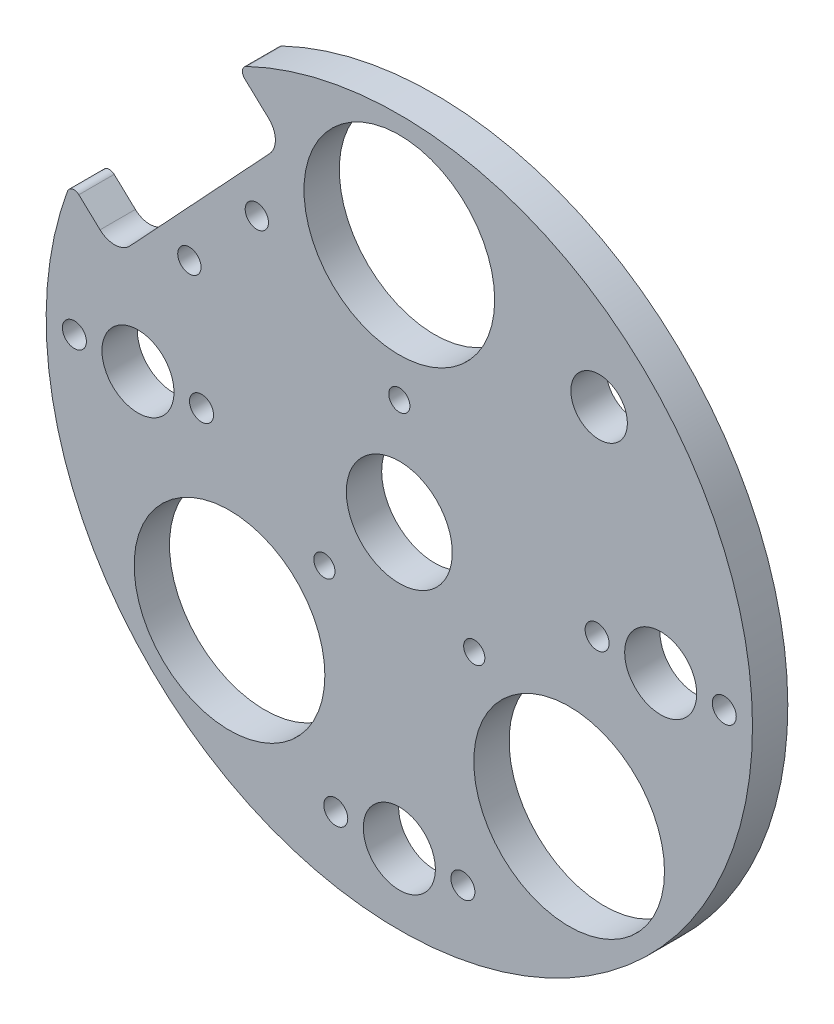
ISO-10303-21;
HEADER;
FILE_DESCRIPTION(('STEP AP214'),'2;1');
FILE_NAME('part.step','',(''),(''),'','','');
FILE_SCHEMA(('AUTOMOTIVE_DESIGN { 1 0 10303 214 1 1 1 1 }'));
ENDSEC;
DATA;
#1=APPLICATION_CONTEXT('core data for automotive mechanical design processes');
#2=APPLICATION_PROTOCOL_DEFINITION('international standard','automotive_design',2000,#1);
#3=PRODUCT_CONTEXT('',#1,'mechanical');
#4=PRODUCT('Part','Part','',(#3));
#5=PRODUCT_RELATED_PRODUCT_CATEGORY('part','',(#4));
#6=PRODUCT_DEFINITION_FORMATION('','',#4);
#7=PRODUCT_DEFINITION_CONTEXT('part definition',#1,'design');
#8=PRODUCT_DEFINITION('design','',#6,#7);
#9=PRODUCT_DEFINITION_SHAPE('','',#8);
#10=(LENGTH_UNIT() NAMED_UNIT(*) SI_UNIT(.MILLI.,.METRE.));
#11=(NAMED_UNIT(*) PLANE_ANGLE_UNIT() SI_UNIT($,.RADIAN.));
#12=(NAMED_UNIT(*) SI_UNIT($,.STERADIAN.) SOLID_ANGLE_UNIT());
#13=UNCERTAINTY_MEASURE_WITH_UNIT(LENGTH_MEASURE(1.E-05),#10,'distance_accuracy_value','');
#14=(GEOMETRIC_REPRESENTATION_CONTEXT(3) GLOBAL_UNCERTAINTY_ASSIGNED_CONTEXT((#13)) GLOBAL_UNIT_ASSIGNED_CONTEXT((#10,
#11,#12)) REPRESENTATION_CONTEXT('',''));
#15=CARTESIAN_POINT('',(0.,0.,0.));
#16=DIRECTION('',(0.,0.,1.));
#17=DIRECTION('',(1.,0.,0.));
#18=AXIS2_PLACEMENT_3D('',#15,#16,#17);
#19=CARTESIAN_POINT('',(0.,0.,5.));
#20=DIRECTION('',(0.,0.,-1.));
#21=DIRECTION('',(-1.,0.,0.));
#22=AXIS2_PLACEMENT_3D('',#19,#20,#21);
#23=CYLINDRICAL_SURFACE('',#22,50.);
#24=CARTESIAN_POINT('',(0.,0.,5.));
#25=DIRECTION('',(0.,0.,1.));
#26=DIRECTION('',(1.,0.,0.));
#27=AXIS2_PLACEMENT_3D('',#24,#25,#26);
#28=CIRCLE('',#27,50.);
#29=CARTESIAN_POINT('',(-46.9912122947557,17.0829144781915,5.));
#30=VERTEX_POINT('',#29);
#31=CARTESIAN_POINT('',(-21.6459347442073,45.0716486169468,5.));
#32=VERTEX_POINT('',#31);
#33=EDGE_CURVE('E219',#30,#32,#28,.T.);
#34=ORIENTED_EDGE('',*,*,#33,.F.);
#35=DIRECTION('',(0.,0.,-1.));
#36=VECTOR('',#35,1.);
#37=CARTESIAN_POINT('',(-46.9912122947557,17.0829144781915,5.));
#38=LINE('',#37,#36);
#39=CARTESIAN_POINT('',(-46.9912122947557,17.0829144781915,0.));
#40=VERTEX_POINT('',#39);
#41=EDGE_CURVE('E263',#30,#40,#38,.T.);
#42=ORIENTED_EDGE('',*,*,#41,.T.);
#43=CARTESIAN_POINT('',(0.,0.,0.));
#44=DIRECTION('',(0.,0.,1.));
#45=DIRECTION('',(1.,0.,0.));
#46=AXIS2_PLACEMENT_3D('',#43,#44,#45);
#47=CIRCLE('',#46,50.);
#48=CARTESIAN_POINT('',(-21.6459347442073,45.0716486169468,0.));
#49=VERTEX_POINT('',#48);
#50=EDGE_CURVE('E218',#40,#49,#47,.T.);
#51=ORIENTED_EDGE('',*,*,#50,.T.);
#52=DIRECTION('',(0.,0.,-1.));
#53=VECTOR('',#52,1.);
#54=CARTESIAN_POINT('',(-21.6459347442073,45.0716486169468,5.));
#55=LINE('',#54,#53);
#56=EDGE_CURVE('E251',#49,#32,#55,.F.);
#57=ORIENTED_EDGE('',*,*,#56,.T.);
#58=EDGE_LOOP('',(#34,#42,#51,#57));
#59=FACE_BOUND('',#58,.T.);
#60=ADVANCED_FACE('F34',(#59),#23,.T.);
#61=CARTESIAN_POINT('',(0.,0.,5.));
#62=DIRECTION('',(0.,0.,1.));
#63=DIRECTION('',(1.,0.,0.));
#64=AXIS2_PLACEMENT_3D('',#61,#62,#63);
#65=PLANE('',#64);
#66=CARTESIAN_POINT('',(28.2842712474618,28.284271247462,5.));
#67=DIRECTION('',(0.,0.,1.));
#68=DIRECTION('',(1.,0.,0.));
#69=AXIS2_PLACEMENT_3D('',#66,#67,#68);
#70=CIRCLE('',#69,4.00000000000002);
#71=CARTESIAN_POINT('',(32.2842712474619,28.284271247462,5.));
#72=VERTEX_POINT('',#71);
#73=EDGE_CURVE('E260',#72,#72,#70,.T.);
#74=ORIENTED_EDGE('',*,*,#73,.F.);
#75=EDGE_LOOP('',(#74));
#76=FACE_BOUND('',#75,.T.);
#77=CARTESIAN_POINT('',(-29.7224002312923,17.238494510021,5.));
#78=DIRECTION('',(0.,0.,1.));
#79=DIRECTION('',(1.,0.,0.));
#80=AXIS2_PLACEMENT_3D('',#77,#78,#79);
#81=CIRCLE('',#80,1.65);
#82=CARTESIAN_POINT('',(-28.0724002312923,17.238494510021,5.));
#83=VERTEX_POINT('',#82);
#84=EDGE_CURVE('E259',#83,#83,#81,.T.);
#85=ORIENTED_EDGE('',*,*,#84,.F.);
#86=EDGE_LOOP('',(#85));
#87=FACE_BOUND('',#86,.T.);
#88=CARTESIAN_POINT('',(-20.1744231904173,27.4774463326893,5.));
#89=DIRECTION('',(0.,0.,1.));
#90=DIRECTION('',(1.,0.,0.));
#91=AXIS2_PLACEMENT_3D('',#88,#89,#90);
#92=CIRCLE('',#91,1.65);
#93=CARTESIAN_POINT('',(-18.5244231904173,27.4774463326893,5.));
#94=VERTEX_POINT('',#93);
#95=EDGE_CURVE('E106',#94,#94,#92,.T.);
#96=ORIENTED_EDGE('',*,*,#95,.F.);
#97=EDGE_LOOP('',(#96));
#98=FACE_BOUND('',#97,.T.);
#99=DIRECTION('',(0.731353701619167,-0.681998360062502,0.));
#100=VECTOR('',#99,1.);
#101=CARTESIAN_POINT('',(-42.3685357740924,14.6742683434885,5.));
#102=LINE('',#101,#100);
#103=CARTESIAN_POINT('',(-45.369389688798,17.4726098902468,5.));
#104=VERTEX_POINT('',#103);
#105=CARTESIAN_POINT('',(-42.3685357740924,14.6742683434885,5.));
#106=VERTEX_POINT('',#105);
#107=EDGE_CURVE('E98',#104,#106,#102,.T.);
#108=ORIENTED_EDGE('',*,*,#107,.F.);
#109=CARTESIAN_POINT('',(-46.0513880488605,16.7412561886277,5.));
#110=DIRECTION('',(0.,0.,1.));
#111=DIRECTION('',(1.,0.,0.));
#112=AXIS2_PLACEMENT_3D('',#109,#110,#111);
#113=CIRCLE('',#112,1.);
#114=EDGE_CURVE('E42',#104,#30,#113,.T.);
#115=ORIENTED_EDGE('',*,*,#114,.T.);
#116=ORIENTED_EDGE('',*,*,#33,.T.);
#117=CARTESIAN_POINT('',(-21.2130160493232,44.1702156446078,5.));
#118=DIRECTION('',(0.,0.,1.));
#119=DIRECTION('',(1.,0.,0.));
#120=AXIS2_PLACEMENT_3D('',#117,#118,#119);
#121=CIRCLE('',#120,1.);
#122=CARTESIAN_POINT('',(-21.8950144093857,43.4388619429887,5.));
#123=VERTEX_POINT('',#122);
#124=EDGE_CURVE('E49',#32,#123,#121,.T.);
#125=ORIENTED_EDGE('',*,*,#124,.T.);
#126=DIRECTION('',(-0.731353701619168,0.681998360062501,0.));
#127=VECTOR('',#126,1.);
#128=CARTESIAN_POINT('',(-27.2748375913348,48.4556282209094,5.));
#129=LINE('',#128,#127);
#130=CARTESIAN_POINT('',(-18.4985931719048,40.2716479001594,5.));
#131=VERTEX_POINT('',#130);
#132=EDGE_CURVE('E116',#131,#123,#129,.T.);
#133=ORIENTED_EDGE('',*,*,#132,.F.);
#134=CARTESIAN_POINT('',(-20.5445882520923,38.0775867953019,5.));
#135=DIRECTION('',(0.,0.,1.));
#136=DIRECTION('',(-1.,0.,0.));
#137=AXIS2_PLACEMENT_3D('',#134,#135,#136);
#138=CIRCLE('',#137,3.);
#139=CARTESIAN_POINT('',(-18.3505271472348,36.0315917151144,5.));
#140=VERTEX_POINT('',#139);
#141=EDGE_CURVE('E124',#140,#131,#138,.T.);
#142=ORIENTED_EDGE('',*,*,#141,.F.);
#143=DIRECTION('',(0.681998360062502,0.731353701619167,0.));
#144=VECTOR('',#143,1.);
#145=CARTESIAN_POINT('',(-18.3505271472348,36.0315917151144,5.));
#146=LINE('',#145,#144);
#147=CARTESIAN_POINT('',(-38.1284795890474,14.8223343681585,5.));
#148=VERTEX_POINT('',#147);
#149=EDGE_CURVE('E122',#148,#140,#146,.T.);
#150=ORIENTED_EDGE('',*,*,#149,.F.);
#151=CARTESIAN_POINT('',(-40.3225406939049,16.868329448346,5.));
#152=DIRECTION('',(0.,0.,1.));
#153=DIRECTION('',(1.,0.,0.));
#154=AXIS2_PLACEMENT_3D('',#151,#152,#153);
#155=CIRCLE('',#154,3.);
#156=EDGE_CURVE('E105',#106,#148,#155,.T.);
#157=ORIENTED_EDGE('',*,*,#156,.F.);
#158=EDGE_LOOP('',(#108,#115,#116,#125,#133,#142,#150,#157));
#159=FACE_BOUND('',#158,.T.);
#160=CARTESIAN_POINT('',(0.,34.,5.));
#161=DIRECTION('',(0.,0.,1.));
#162=DIRECTION('',(1.,0.,0.));
#163=AXIS2_PLACEMENT_3D('',#160,#161,#162);
#164=CIRCLE('',#163,13.5);
#165=CARTESIAN_POINT('',(13.5,34.,5.));
#166=VERTEX_POINT('',#165);
#167=EDGE_CURVE('E140',#166,#166,#164,.T.);
#168=ORIENTED_EDGE('',*,*,#167,.F.);
#169=EDGE_LOOP('',(#168));
#170=FACE_BOUND('',#169,.T.);
#171=CARTESIAN_POINT('',(-10.6066017177983,-10.6066017177982,5.));
#172=DIRECTION('',(0.,0.,1.));
#173=DIRECTION('',(1.,0.,0.));
#174=AXIS2_PLACEMENT_3D('',#171,#172,#173);
#175=CIRCLE('',#174,1.5);
#176=CARTESIAN_POINT('',(-9.10660171779826,-10.6066017177982,5.));
#177=VERTEX_POINT('',#176);
#178=EDGE_CURVE('E142',#177,#177,#175,.T.);
#179=ORIENTED_EDGE('',*,*,#178,.F.);
#180=EDGE_LOOP('',(#179));
#181=FACE_BOUND('',#180,.T.);
#182=CARTESIAN_POINT('',(-24.0416305603427,-24.0416305603425,5.));
#183=DIRECTION('',(0.,0.,1.));
#184=DIRECTION('',(1.,0.,0.));
#185=AXIS2_PLACEMENT_3D('',#182,#183,#184);
#186=CIRCLE('',#185,13.5);
#187=CARTESIAN_POINT('',(-10.5416305603427,-24.0416305603425,5.));
#188=VERTEX_POINT('',#187);
#189=EDGE_CURVE('E145',#188,#188,#186,.T.);
#190=ORIENTED_EDGE('',*,*,#189,.F.);
#191=EDGE_LOOP('',(#190));
#192=FACE_BOUND('',#191,.T.);
#193=CARTESIAN_POINT('',(10.6066017177982,-10.6066017177982,5.));
#194=DIRECTION('',(0.,0.,1.));
#195=DIRECTION('',(1.,0.,0.));
#196=AXIS2_PLACEMENT_3D('',#193,#194,#195);
#197=CIRCLE('',#196,1.5);
#198=CARTESIAN_POINT('',(12.1066017177982,-10.6066017177982,5.));
#199=VERTEX_POINT('',#198);
#200=EDGE_CURVE('E148',#199,#199,#197,.T.);
#201=ORIENTED_EDGE('',*,*,#200,.F.);
#202=EDGE_LOOP('',(#201));
#203=FACE_BOUND('',#202,.T.);
#204=CARTESIAN_POINT('',(0.,15.,5.));
#205=DIRECTION('',(0.,0.,1.));
#206=DIRECTION('',(1.,0.,0.));
#207=AXIS2_PLACEMENT_3D('',#204,#205,#206);
#208=CIRCLE('',#207,1.5);
#209=CARTESIAN_POINT('',(1.5,15.,5.));
#210=VERTEX_POINT('',#209);
#211=EDGE_CURVE('E137',#210,#210,#208,.T.);
#212=ORIENTED_EDGE('',*,*,#211,.F.);
#213=EDGE_LOOP('',(#212));
#214=FACE_BOUND('',#213,.T.);
#215=CARTESIAN_POINT('',(24.0416305603426,-24.0416305603427,5.));
#216=DIRECTION('',(0.,0.,1.));
#217=DIRECTION('',(1.,0.,0.));
#218=AXIS2_PLACEMENT_3D('',#215,#216,#217);
#219=CIRCLE('',#218,13.5);
#220=CARTESIAN_POINT('',(37.5416305603426,-24.0416305603427,5.));
#221=VERTEX_POINT('',#220);
#222=EDGE_CURVE('E151',#221,#221,#219,.T.);
#223=ORIENTED_EDGE('',*,*,#222,.F.);
#224=EDGE_LOOP('',(#223));
#225=FACE_BOUND('',#224,.T.);
#226=CARTESIAN_POINT('',(46.,0.,5.));
#227=DIRECTION('',(0.,0.,1.));
#228=DIRECTION('',(1.,0.,0.));
#229=AXIS2_PLACEMENT_3D('',#226,#227,#228);
#230=CIRCLE('',#229,1.7);
#231=CARTESIAN_POINT('',(47.7,0.,5.));
#232=VERTEX_POINT('',#231);
#233=EDGE_CURVE('E157',#232,#232,#230,.T.);
#234=ORIENTED_EDGE('',*,*,#233,.F.);
#235=EDGE_LOOP('',(#234));
#236=FACE_BOUND('',#235,.T.);
#237=CARTESIAN_POINT('',(28.,0.,5.));
#238=DIRECTION('',(0.,0.,1.));
#239=DIRECTION('',(1.,0.,0.));
#240=AXIS2_PLACEMENT_3D('',#237,#238,#239);
#241=CIRCLE('',#240,1.7);
#242=CARTESIAN_POINT('',(29.7,0.,5.));
#243=VERTEX_POINT('',#242);
#244=EDGE_CURVE('E164',#243,#243,#241,.T.);
#245=ORIENTED_EDGE('',*,*,#244,.F.);
#246=EDGE_LOOP('',(#245));
#247=FACE_BOUND('',#246,.T.);
#248=CARTESIAN_POINT('',(9.,-40.,5.));
#249=DIRECTION('',(0.,0.,1.));
#250=DIRECTION('',(1.,0.,0.));
#251=AXIS2_PLACEMENT_3D('',#248,#249,#250);
#252=CIRCLE('',#251,1.7);
#253=CARTESIAN_POINT('',(10.7,-40.,5.));
#254=VERTEX_POINT('',#253);
#255=EDGE_CURVE('E170',#254,#254,#252,.T.);
#256=ORIENTED_EDGE('',*,*,#255,.F.);
#257=EDGE_LOOP('',(#256));
#258=FACE_BOUND('',#257,.T.);
#259=CARTESIAN_POINT('',(-9.,-40.,5.));
#260=DIRECTION('',(0.,0.,1.));
#261=DIRECTION('',(1.,0.,0.));
#262=AXIS2_PLACEMENT_3D('',#259,#260,#261);
#263=CIRCLE('',#262,1.7);
#264=CARTESIAN_POINT('',(-7.3,-40.,5.));
#265=VERTEX_POINT('',#264);
#266=EDGE_CURVE('E176',#265,#265,#263,.T.);
#267=ORIENTED_EDGE('',*,*,#266,.F.);
#268=EDGE_LOOP('',(#267));
#269=FACE_BOUND('',#268,.T.);
#270=CARTESIAN_POINT('',(-46.,2.97129651685814E-13,5.));
#271=DIRECTION('',(0.,0.,1.));
#272=DIRECTION('',(1.,0.,0.));
#273=AXIS2_PLACEMENT_3D('',#270,#271,#272);
#274=CIRCLE('',#273,1.7);
#275=CARTESIAN_POINT('',(-44.3,2.97129651685814E-13,5.));
#276=VERTEX_POINT('',#275);
#277=EDGE_CURVE('E182',#276,#276,#274,.T.);
#278=ORIENTED_EDGE('',*,*,#277,.F.);
#279=EDGE_LOOP('',(#278));
#280=FACE_BOUND('',#279,.T.);
#281=CARTESIAN_POINT('',(-28.,-1.71810817162361E-12,5.));
#282=DIRECTION('',(0.,0.,1.));
#283=DIRECTION('',(1.,0.,0.));
#284=AXIS2_PLACEMENT_3D('',#281,#282,#283);
#285=CIRCLE('',#284,1.7);
#286=CARTESIAN_POINT('',(-26.3,-1.71810817162361E-12,5.));
#287=VERTEX_POINT('',#286);
#288=EDGE_CURVE('E188',#287,#287,#285,.T.);
#289=ORIENTED_EDGE('',*,*,#288,.F.);
#290=EDGE_LOOP('',(#289));
#291=FACE_BOUND('',#290,.T.);
#292=CARTESIAN_POINT('',(-37.,0.,5.));
#293=DIRECTION('',(0.,0.,-1.));
#294=DIRECTION('',(-1.,0.,0.));
#295=AXIS2_PLACEMENT_3D('',#292,#293,#294);
#296=CIRCLE('',#295,5.1);
#297=CARTESIAN_POINT('',(-42.1,0.,5.));
#298=VERTEX_POINT('',#297);
#299=EDGE_CURVE('E197',#298,#298,#296,.T.);
#300=ORIENTED_EDGE('',*,*,#299,.T.);
#301=EDGE_LOOP('',(#300));
#302=FACE_BOUND('',#301,.T.);
#303=CARTESIAN_POINT('',(37.,2.68166793467571E-13,5.));
#304=DIRECTION('',(0.,0.,-1.));
#305=DIRECTION('',(-1.,0.,0.));
#306=AXIS2_PLACEMENT_3D('',#303,#304,#305);
#307=CIRCLE('',#306,5.1);
#308=CARTESIAN_POINT('',(31.9,2.68166793467571E-13,5.));
#309=VERTEX_POINT('',#308);
#310=EDGE_CURVE('E203',#309,#309,#307,.T.);
#311=ORIENTED_EDGE('',*,*,#310,.T.);
#312=EDGE_LOOP('',(#311));
#313=FACE_BOUND('',#312,.T.);
#314=CARTESIAN_POINT('',(0.,-40.,5.));
#315=DIRECTION('',(0.,0.,-1.));
#316=DIRECTION('',(-1.,0.,0.));
#317=AXIS2_PLACEMENT_3D('',#314,#315,#316);
#318=CIRCLE('',#317,5.1);
#319=CARTESIAN_POINT('',(-5.1,-40.,5.));
#320=VERTEX_POINT('',#319);
#321=EDGE_CURVE('E209',#320,#320,#318,.T.);
#322=ORIENTED_EDGE('',*,*,#321,.T.);
#323=EDGE_LOOP('',(#322));
#324=FACE_BOUND('',#323,.T.);
#325=CARTESIAN_POINT('',(0.,0.,5.));
#326=DIRECTION('',(0.,0.,-1.));
#327=DIRECTION('',(-1.,0.,0.));
#328=AXIS2_PLACEMENT_3D('',#325,#326,#327);
#329=CIRCLE('',#328,7.5);
#330=CARTESIAN_POINT('',(-7.5,0.,5.));
#331=VERTEX_POINT('',#330);
#332=EDGE_CURVE('E215',#331,#331,#329,.T.);
#333=ORIENTED_EDGE('',*,*,#332,.T.);
#334=EDGE_LOOP('',(#333));
#335=FACE_BOUND('',#334,.T.);
#336=ADVANCED_FACE('F118',(#76,#87,#98,#159,#170,#181,#192,#203,#214,#225,#236,#247,#258,#269,
#280,#291,#302,#313,#324,#335),#65,.T.);
#337=CARTESIAN_POINT('',(0.,0.,0.));
#338=DIRECTION('',(0.,0.,1.));
#339=DIRECTION('',(1.,0.,0.));
#340=AXIS2_PLACEMENT_3D('',#337,#338,#339);
#341=PLANE('',#340);
#342=CARTESIAN_POINT('',(28.2842712474618,28.284271247462,0.));
#343=DIRECTION('',(0.,0.,1.));
#344=DIRECTION('',(1.,0.,0.));
#345=AXIS2_PLACEMENT_3D('',#342,#343,#344);
#346=CIRCLE('',#345,4.00000000000002);
#347=CARTESIAN_POINT('',(32.2842712474619,28.284271247462,0.));
#348=VERTEX_POINT('',#347);
#349=EDGE_CURVE('E256',#348,#348,#346,.T.);
#350=ORIENTED_EDGE('',*,*,#349,.T.);
#351=EDGE_LOOP('',(#350));
#352=FACE_BOUND('',#351,.T.);
#353=CARTESIAN_POINT('',(-29.7224002312923,17.238494510021,0.));
#354=DIRECTION('',(0.,0.,1.));
#355=DIRECTION('',(1.,0.,0.));
#356=AXIS2_PLACEMENT_3D('',#353,#354,#355);
#357=CIRCLE('',#356,1.65);
#358=CARTESIAN_POINT('',(-28.0724002312923,17.238494510021,0.));
#359=VERTEX_POINT('',#358);
#360=EDGE_CURVE('E141',#359,#359,#357,.T.);
#361=ORIENTED_EDGE('',*,*,#360,.T.);
#362=EDGE_LOOP('',(#361));
#363=FACE_BOUND('',#362,.T.);
#364=CARTESIAN_POINT('',(-20.1744231904173,27.4774463326893,0.));
#365=DIRECTION('',(0.,0.,1.));
#366=DIRECTION('',(1.,0.,0.));
#367=AXIS2_PLACEMENT_3D('',#364,#365,#366);
#368=CIRCLE('',#367,1.65);
#369=CARTESIAN_POINT('',(-18.5244231904173,27.4774463326893,0.));
#370=VERTEX_POINT('',#369);
#371=EDGE_CURVE('E133',#370,#370,#368,.T.);
#372=ORIENTED_EDGE('',*,*,#371,.T.);
#373=EDGE_LOOP('',(#372));
#374=FACE_BOUND('',#373,.T.);
#375=CARTESIAN_POINT('',(0.,34.,0.));
#376=DIRECTION('',(0.,0.,1.));
#377=DIRECTION('',(1.,0.,0.));
#378=AXIS2_PLACEMENT_3D('',#375,#376,#377);
#379=CIRCLE('',#378,13.5);
#380=CARTESIAN_POINT('',(13.5,34.,0.));
#381=VERTEX_POINT('',#380);
#382=EDGE_CURVE('E161',#381,#381,#379,.T.);
#383=ORIENTED_EDGE('',*,*,#382,.T.);
#384=EDGE_LOOP('',(#383));
#385=FACE_BOUND('',#384,.T.);
#386=CARTESIAN_POINT('',(-10.6066017177983,-10.6066017177982,0.));
#387=DIRECTION('',(0.,0.,1.));
#388=DIRECTION('',(1.,0.,0.));
#389=AXIS2_PLACEMENT_3D('',#386,#387,#388);
#390=CIRCLE('',#389,1.5);
#391=CARTESIAN_POINT('',(-9.10660171779826,-10.6066017177982,0.));
#392=VERTEX_POINT('',#391);
#393=EDGE_CURVE('E235',#392,#392,#390,.T.);
#394=ORIENTED_EDGE('',*,*,#393,.T.);
#395=EDGE_LOOP('',(#394));
#396=FACE_BOUND('',#395,.T.);
#397=CARTESIAN_POINT('',(-24.0416305603427,-24.0416305603425,0.));
#398=DIRECTION('',(0.,0.,1.));
#399=DIRECTION('',(1.,0.,0.));
#400=AXIS2_PLACEMENT_3D('',#397,#398,#399);
#401=CIRCLE('',#400,13.5);
#402=CARTESIAN_POINT('',(-10.5416305603427,-24.0416305603425,0.));
#403=VERTEX_POINT('',#402);
#404=EDGE_CURVE('E232',#403,#403,#401,.T.);
#405=ORIENTED_EDGE('',*,*,#404,.T.);
#406=EDGE_LOOP('',(#405));
#407=FACE_BOUND('',#406,.T.);
#408=CARTESIAN_POINT('',(10.6066017177982,-10.6066017177982,0.));
#409=DIRECTION('',(0.,0.,1.));
#410=DIRECTION('',(1.,0.,0.));
#411=AXIS2_PLACEMENT_3D('',#408,#409,#410);
#412=CIRCLE('',#411,1.5);
#413=CARTESIAN_POINT('',(12.1066017177982,-10.6066017177982,0.));
#414=VERTEX_POINT('',#413);
#415=EDGE_CURVE('E229',#414,#414,#412,.T.);
#416=ORIENTED_EDGE('',*,*,#415,.T.);
#417=EDGE_LOOP('',(#416));
#418=FACE_BOUND('',#417,.T.);
#419=CARTESIAN_POINT('',(0.,15.,0.));
#420=DIRECTION('',(0.,0.,1.));
#421=DIRECTION('',(1.,0.,0.));
#422=AXIS2_PLACEMENT_3D('',#419,#420,#421);
#423=CIRCLE('',#422,1.5);
#424=CARTESIAN_POINT('',(1.5,15.,0.));
#425=VERTEX_POINT('',#424);
#426=EDGE_CURVE('E226',#425,#425,#423,.T.);
#427=ORIENTED_EDGE('',*,*,#426,.T.);
#428=EDGE_LOOP('',(#427));
#429=FACE_BOUND('',#428,.T.);
#430=CARTESIAN_POINT('',(24.0416305603426,-24.0416305603427,0.));
#431=DIRECTION('',(0.,0.,1.));
#432=DIRECTION('',(1.,0.,0.));
#433=AXIS2_PLACEMENT_3D('',#430,#431,#432);
#434=CIRCLE('',#433,13.5);
#435=CARTESIAN_POINT('',(37.5416305603426,-24.0416305603427,0.));
#436=VERTEX_POINT('',#435);
#437=EDGE_CURVE('E156',#436,#436,#434,.T.);
#438=ORIENTED_EDGE('',*,*,#437,.T.);
#439=EDGE_LOOP('',(#438));
#440=FACE_BOUND('',#439,.T.);
#441=CARTESIAN_POINT('',(46.,0.,0.));
#442=DIRECTION('',(0.,0.,1.));
#443=DIRECTION('',(1.,0.,0.));
#444=AXIS2_PLACEMENT_3D('',#441,#442,#443);
#445=CIRCLE('',#444,1.7);
#446=CARTESIAN_POINT('',(47.7,0.,0.));
#447=VERTEX_POINT('',#446);
#448=EDGE_CURVE('E160',#447,#447,#445,.T.);
#449=ORIENTED_EDGE('',*,*,#448,.T.);
#450=EDGE_LOOP('',(#449));
#451=FACE_BOUND('',#450,.T.);
#452=CARTESIAN_POINT('',(28.,0.,0.));
#453=DIRECTION('',(0.,0.,1.));
#454=DIRECTION('',(1.,0.,0.));
#455=AXIS2_PLACEMENT_3D('',#452,#453,#454);
#456=CIRCLE('',#455,1.7);
#457=CARTESIAN_POINT('',(29.7,0.,0.));
#458=VERTEX_POINT('',#457);
#459=EDGE_CURVE('E167',#458,#458,#456,.T.);
#460=ORIENTED_EDGE('',*,*,#459,.T.);
#461=EDGE_LOOP('',(#460));
#462=FACE_BOUND('',#461,.T.);
#463=CARTESIAN_POINT('',(9.,-40.,0.));
#464=DIRECTION('',(0.,0.,1.));
#465=DIRECTION('',(1.,0.,0.));
#466=AXIS2_PLACEMENT_3D('',#463,#464,#465);
#467=CIRCLE('',#466,1.7);
#468=CARTESIAN_POINT('',(10.7,-40.,0.));
#469=VERTEX_POINT('',#468);
#470=EDGE_CURVE('E173',#469,#469,#467,.T.);
#471=ORIENTED_EDGE('',*,*,#470,.T.);
#472=EDGE_LOOP('',(#471));
#473=FACE_BOUND('',#472,.T.);
#474=CARTESIAN_POINT('',(-9.,-40.,0.));
#475=DIRECTION('',(0.,0.,1.));
#476=DIRECTION('',(1.,0.,0.));
#477=AXIS2_PLACEMENT_3D('',#474,#475,#476);
#478=CIRCLE('',#477,1.7);
#479=CARTESIAN_POINT('',(-7.3,-40.,0.));
#480=VERTEX_POINT('',#479);
#481=EDGE_CURVE('E179',#480,#480,#478,.T.);
#482=ORIENTED_EDGE('',*,*,#481,.T.);
#483=EDGE_LOOP('',(#482));
#484=FACE_BOUND('',#483,.T.);
#485=CARTESIAN_POINT('',(-46.,2.97129651685814E-13,0.));
#486=DIRECTION('',(0.,0.,1.));
#487=DIRECTION('',(1.,0.,0.));
#488=AXIS2_PLACEMENT_3D('',#485,#486,#487);
#489=CIRCLE('',#488,1.7);
#490=CARTESIAN_POINT('',(-44.3,2.97129651685814E-13,0.));
#491=VERTEX_POINT('',#490);
#492=EDGE_CURVE('E185',#491,#491,#489,.T.);
#493=ORIENTED_EDGE('',*,*,#492,.T.);
#494=EDGE_LOOP('',(#493));
#495=FACE_BOUND('',#494,.T.);
#496=CARTESIAN_POINT('',(-28.,-1.71810817162361E-12,0.));
#497=DIRECTION('',(0.,0.,1.));
#498=DIRECTION('',(1.,0.,0.));
#499=AXIS2_PLACEMENT_3D('',#496,#497,#498);
#500=CIRCLE('',#499,1.7);
#501=CARTESIAN_POINT('',(-26.3,-1.71810817162361E-12,0.));
#502=VERTEX_POINT('',#501);
#503=EDGE_CURVE('E191',#502,#502,#500,.T.);
#504=ORIENTED_EDGE('',*,*,#503,.T.);
#505=EDGE_LOOP('',(#504));
#506=FACE_BOUND('',#505,.T.);
#507=CARTESIAN_POINT('',(-37.,0.,0.));
#508=DIRECTION('',(0.,0.,-1.));
#509=DIRECTION('',(-1.,0.,0.));
#510=AXIS2_PLACEMENT_3D('',#507,#508,#509);
#511=CIRCLE('',#510,5.1);
#512=CARTESIAN_POINT('',(-42.1,0.,0.));
#513=VERTEX_POINT('',#512);
#514=EDGE_CURVE('E194',#513,#513,#511,.T.);
#515=ORIENTED_EDGE('',*,*,#514,.F.);
#516=EDGE_LOOP('',(#515));
#517=FACE_BOUND('',#516,.T.);
#518=CARTESIAN_POINT('',(37.,2.68166793467571E-13,0.));
#519=DIRECTION('',(0.,0.,-1.));
#520=DIRECTION('',(-1.,0.,0.));
#521=AXIS2_PLACEMENT_3D('',#518,#519,#520);
#522=CIRCLE('',#521,5.1);
#523=CARTESIAN_POINT('',(31.9,2.68166793467571E-13,0.));
#524=VERTEX_POINT('',#523);
#525=EDGE_CURVE('E200',#524,#524,#522,.T.);
#526=ORIENTED_EDGE('',*,*,#525,.F.);
#527=EDGE_LOOP('',(#526));
#528=FACE_BOUND('',#527,.T.);
#529=CARTESIAN_POINT('',(0.,-40.,0.));
#530=DIRECTION('',(0.,0.,-1.));
#531=DIRECTION('',(-1.,0.,0.));
#532=AXIS2_PLACEMENT_3D('',#529,#530,#531);
#533=CIRCLE('',#532,5.1);
#534=CARTESIAN_POINT('',(-5.1,-40.,0.));
#535=VERTEX_POINT('',#534);
#536=EDGE_CURVE('E206',#535,#535,#533,.T.);
#537=ORIENTED_EDGE('',*,*,#536,.F.);
#538=EDGE_LOOP('',(#537));
#539=FACE_BOUND('',#538,.T.);
#540=CARTESIAN_POINT('',(0.,0.,0.));
#541=DIRECTION('',(0.,0.,-1.));
#542=DIRECTION('',(-1.,0.,0.));
#543=AXIS2_PLACEMENT_3D('',#540,#541,#542);
#544=CIRCLE('',#543,7.5);
#545=CARTESIAN_POINT('',(-7.5,0.,0.));
#546=VERTEX_POINT('',#545);
#547=EDGE_CURVE('E212',#546,#546,#544,.T.);
#548=ORIENTED_EDGE('',*,*,#547,.F.);
#549=EDGE_LOOP('',(#548));
#550=FACE_BOUND('',#549,.T.);
#551=ORIENTED_EDGE('',*,*,#50,.F.);
#552=CARTESIAN_POINT('',(-46.0513880488605,16.7412561886277,0.));
#553=DIRECTION('',(0.,0.,1.));
#554=DIRECTION('',(1.,0.,0.));
#555=AXIS2_PLACEMENT_3D('',#552,#553,#554);
#556=CIRCLE('',#555,1.);
#557=CARTESIAN_POINT('',(-45.369389688798,17.4726098902468,0.));
#558=VERTEX_POINT('',#557);
#559=EDGE_CURVE('E268',#40,#558,#556,.F.);
#560=ORIENTED_EDGE('',*,*,#559,.T.);
#561=DIRECTION('',(0.731353701619167,-0.681998360062502,0.));
#562=VECTOR('',#561,1.);
#563=CARTESIAN_POINT('',(-12.3872667787302,-13.2837172962384,0.));
#564=LINE('',#563,#562);
#565=CARTESIAN_POINT('',(-42.3685357740924,14.6742683434885,0.));
#566=VERTEX_POINT('',#565);
#567=EDGE_CURVE('E221',#558,#566,#564,.T.);
#568=ORIENTED_EDGE('',*,*,#567,.T.);
#569=CARTESIAN_POINT('',(-40.3225406939049,16.868329448346,0.));
#570=DIRECTION('',(0.,0.,1.));
#571=DIRECTION('',(1.,0.,0.));
#572=AXIS2_PLACEMENT_3D('',#569,#570,#571);
#573=CIRCLE('',#572,3.);
#574=CARTESIAN_POINT('',(-38.1284795890474,14.8223343681585,0.));
#575=VERTEX_POINT('',#574);
#576=EDGE_CURVE('E114',#566,#575,#573,.T.);
#577=ORIENTED_EDGE('',*,*,#576,.T.);
#578=DIRECTION('',(0.681998360062502,0.731353701619167,0.));
#579=VECTOR('',#578,1.);
#580=CARTESIAN_POINT('',(-27.7872078905047,25.9119905595393,0.));
#581=LINE('',#580,#579);
#582=CARTESIAN_POINT('',(-18.3505271472348,36.0315917151144,0.));
#583=VERTEX_POINT('',#582);
#584=EDGE_CURVE('E242',#575,#583,#581,.T.);
#585=ORIENTED_EDGE('',*,*,#584,.T.);
#586=CARTESIAN_POINT('',(-20.5445882520923,38.0775867953019,0.));
#587=DIRECTION('',(0.,0.,1.));
#588=DIRECTION('',(1.,0.,0.));
#589=AXIS2_PLACEMENT_3D('',#586,#587,#588);
#590=CIRCLE('',#589,3.);
#591=CARTESIAN_POINT('',(-18.4985931719048,40.2716479001594,0.));
#592=VERTEX_POINT('',#591);
#593=EDGE_CURVE('E245',#583,#592,#590,.T.);
#594=ORIENTED_EDGE('',*,*,#593,.T.);
#595=DIRECTION('',(-0.731353701619168,0.681998360062501,0.));
#596=VECTOR('',#595,1.);
#597=CARTESIAN_POINT('',(11.4826758234574,12.3136622604326,0.));
#598=LINE('',#597,#596);
#599=CARTESIAN_POINT('',(-21.8950144093857,43.4388619429887,0.));
#600=VERTEX_POINT('',#599);
#601=EDGE_CURVE('E248',#592,#600,#598,.T.);
#602=ORIENTED_EDGE('',*,*,#601,.T.);
#603=CARTESIAN_POINT('',(-21.2130160493232,44.1702156446078,0.));
#604=DIRECTION('',(0.,0.,1.));
#605=DIRECTION('',(1.,0.,0.));
#606=AXIS2_PLACEMENT_3D('',#603,#604,#605);
#607=CIRCLE('',#606,1.);
#608=EDGE_CURVE('E266',#600,#49,#607,.F.);
#609=ORIENTED_EDGE('',*,*,#608,.T.);
#610=EDGE_LOOP('',(#551,#560,#568,#577,#585,#594,#602,#609));
#611=FACE_BOUND('',#610,.T.);
#612=ADVANCED_FACE('F279',(#352,#363,#374,#385,#396,#407,#418,#429,#440,#451,#462,#473,#484,
#495,#506,#517,#528,#539,#550,#611),#341,.F.);
#613=CARTESIAN_POINT('',(0.,0.,0.));
#614=DIRECTION('',(0.,0.,-1.));
#615=DIRECTION('',(-1.,0.,0.));
#616=AXIS2_PLACEMENT_3D('',#613,#614,#615);
#617=CYLINDRICAL_SURFACE('',#616,7.5);
#618=ORIENTED_EDGE('',*,*,#332,.F.);
#619=EDGE_LOOP('',(#618));
#620=FACE_BOUND('',#619,.T.);
#621=ORIENTED_EDGE('',*,*,#547,.T.);
#622=EDGE_LOOP('',(#621));
#623=FACE_BOUND('',#622,.T.);
#624=ADVANCED_FACE('F392',(#620,#623),#617,.F.);
#625=CARTESIAN_POINT('',(0.,-40.,0.));
#626=DIRECTION('',(0.,0.,-1.));
#627=DIRECTION('',(-1.,0.,0.));
#628=AXIS2_PLACEMENT_3D('',#625,#626,#627);
#629=CYLINDRICAL_SURFACE('',#628,5.1);
#630=ORIENTED_EDGE('',*,*,#321,.F.);
#631=EDGE_LOOP('',(#630));
#632=FACE_BOUND('',#631,.T.);
#633=ORIENTED_EDGE('',*,*,#536,.T.);
#634=EDGE_LOOP('',(#633));
#635=FACE_BOUND('',#634,.T.);
#636=ADVANCED_FACE('F388',(#632,#635),#629,.F.);
#637=CARTESIAN_POINT('',(37.,2.68166793467571E-13,0.));
#638=DIRECTION('',(0.,0.,-1.));
#639=DIRECTION('',(-1.,0.,0.));
#640=AXIS2_PLACEMENT_3D('',#637,#638,#639);
#641=CYLINDRICAL_SURFACE('',#640,5.1);
#642=ORIENTED_EDGE('',*,*,#310,.F.);
#643=EDGE_LOOP('',(#642));
#644=FACE_BOUND('',#643,.T.);
#645=ORIENTED_EDGE('',*,*,#525,.T.);
#646=EDGE_LOOP('',(#645));
#647=FACE_BOUND('',#646,.T.);
#648=ADVANCED_FACE('F384',(#644,#647),#641,.F.);
#649=CARTESIAN_POINT('',(-37.,0.,0.));
#650=DIRECTION('',(0.,0.,-1.));
#651=DIRECTION('',(-1.,0.,0.));
#652=AXIS2_PLACEMENT_3D('',#649,#650,#651);
#653=CYLINDRICAL_SURFACE('',#652,5.1);
#654=ORIENTED_EDGE('',*,*,#299,.F.);
#655=EDGE_LOOP('',(#654));
#656=FACE_BOUND('',#655,.T.);
#657=ORIENTED_EDGE('',*,*,#514,.T.);
#658=EDGE_LOOP('',(#657));
#659=FACE_BOUND('',#658,.T.);
#660=ADVANCED_FACE('F380',(#656,#659),#653,.F.);
#661=CARTESIAN_POINT('',(-28.,-1.71810817162361E-12,5.));
#662=DIRECTION('',(0.,0.,1.));
#663=DIRECTION('',(1.,0.,0.));
#664=AXIS2_PLACEMENT_3D('',#661,#662,#663);
#665=CYLINDRICAL_SURFACE('',#664,1.7);
#666=ORIENTED_EDGE('',*,*,#503,.F.);
#667=EDGE_LOOP('',(#666));
#668=FACE_BOUND('',#667,.T.);
#669=ORIENTED_EDGE('',*,*,#288,.T.);
#670=EDGE_LOOP('',(#669));
#671=FACE_BOUND('',#670,.T.);
#672=ADVANCED_FACE('F376',(#668,#671),#665,.F.);
#673=CARTESIAN_POINT('',(-46.,2.97129651685814E-13,5.));
#674=DIRECTION('',(0.,0.,1.));
#675=DIRECTION('',(1.,0.,0.));
#676=AXIS2_PLACEMENT_3D('',#673,#674,#675);
#677=CYLINDRICAL_SURFACE('',#676,1.7);
#678=ORIENTED_EDGE('',*,*,#492,.F.);
#679=EDGE_LOOP('',(#678));
#680=FACE_BOUND('',#679,.T.);
#681=ORIENTED_EDGE('',*,*,#277,.T.);
#682=EDGE_LOOP('',(#681));
#683=FACE_BOUND('',#682,.T.);
#684=ADVANCED_FACE('F372',(#680,#683),#677,.F.);
#685=CARTESIAN_POINT('',(-9.,-40.,5.));
#686=DIRECTION('',(0.,0.,1.));
#687=DIRECTION('',(1.,0.,0.));
#688=AXIS2_PLACEMENT_3D('',#685,#686,#687);
#689=CYLINDRICAL_SURFACE('',#688,1.7);
#690=ORIENTED_EDGE('',*,*,#481,.F.);
#691=EDGE_LOOP('',(#690));
#692=FACE_BOUND('',#691,.T.);
#693=ORIENTED_EDGE('',*,*,#266,.T.);
#694=EDGE_LOOP('',(#693));
#695=FACE_BOUND('',#694,.T.);
#696=ADVANCED_FACE('F368',(#692,#695),#689,.F.);
#697=CARTESIAN_POINT('',(9.,-40.,5.));
#698=DIRECTION('',(0.,0.,1.));
#699=DIRECTION('',(1.,0.,0.));
#700=AXIS2_PLACEMENT_3D('',#697,#698,#699);
#701=CYLINDRICAL_SURFACE('',#700,1.7);
#702=ORIENTED_EDGE('',*,*,#470,.F.);
#703=EDGE_LOOP('',(#702));
#704=FACE_BOUND('',#703,.T.);
#705=ORIENTED_EDGE('',*,*,#255,.T.);
#706=EDGE_LOOP('',(#705));
#707=FACE_BOUND('',#706,.T.);
#708=ADVANCED_FACE('F364',(#704,#707),#701,.F.);
#709=CARTESIAN_POINT('',(28.,0.,5.));
#710=DIRECTION('',(0.,0.,1.));
#711=DIRECTION('',(1.,0.,0.));
#712=AXIS2_PLACEMENT_3D('',#709,#710,#711);
#713=CYLINDRICAL_SURFACE('',#712,1.7);
#714=ORIENTED_EDGE('',*,*,#459,.F.);
#715=EDGE_LOOP('',(#714));
#716=FACE_BOUND('',#715,.T.);
#717=ORIENTED_EDGE('',*,*,#244,.T.);
#718=EDGE_LOOP('',(#717));
#719=FACE_BOUND('',#718,.T.);
#720=ADVANCED_FACE('F360',(#716,#719),#713,.F.);
#721=CARTESIAN_POINT('',(46.,0.,5.));
#722=DIRECTION('',(0.,0.,1.));
#723=DIRECTION('',(1.,0.,0.));
#724=AXIS2_PLACEMENT_3D('',#721,#722,#723);
#725=CYLINDRICAL_SURFACE('',#724,1.7);
#726=ORIENTED_EDGE('',*,*,#448,.F.);
#727=EDGE_LOOP('',(#726));
#728=FACE_BOUND('',#727,.T.);
#729=ORIENTED_EDGE('',*,*,#233,.T.);
#730=EDGE_LOOP('',(#729));
#731=FACE_BOUND('',#730,.T.);
#732=ADVANCED_FACE('F356',(#728,#731),#725,.F.);
#733=CARTESIAN_POINT('',(24.0416305603426,-24.0416305603427,-5.));
#734=DIRECTION('',(0.,0.,1.));
#735=DIRECTION('',(1.,0.,0.));
#736=AXIS2_PLACEMENT_3D('',#733,#734,#735);
#737=CYLINDRICAL_SURFACE('',#736,13.5);
#738=ORIENTED_EDGE('',*,*,#222,.T.);
#739=EDGE_LOOP('',(#738));
#740=FACE_BOUND('',#739,.T.);
#741=ORIENTED_EDGE('',*,*,#437,.F.);
#742=EDGE_LOOP('',(#741));
#743=FACE_BOUND('',#742,.T.);
#744=ADVANCED_FACE('F353',(#740,#743),#737,.F.);
#745=CARTESIAN_POINT('',(0.,15.,-5.));
#746=DIRECTION('',(0.,0.,1.));
#747=DIRECTION('',(1.,0.,0.));
#748=AXIS2_PLACEMENT_3D('',#745,#746,#747);
#749=CYLINDRICAL_SURFACE('',#748,1.5);
#750=ORIENTED_EDGE('',*,*,#211,.T.);
#751=EDGE_LOOP('',(#750));
#752=FACE_BOUND('',#751,.T.);
#753=ORIENTED_EDGE('',*,*,#426,.F.);
#754=EDGE_LOOP('',(#753));
#755=FACE_BOUND('',#754,.T.);
#756=ADVANCED_FACE('F348',(#752,#755),#749,.F.);
#757=CARTESIAN_POINT('',(10.6066017177982,-10.6066017177982,-5.));
#758=DIRECTION('',(0.,0.,1.));
#759=DIRECTION('',(1.,0.,0.));
#760=AXIS2_PLACEMENT_3D('',#757,#758,#759);
#761=CYLINDRICAL_SURFACE('',#760,1.5);
#762=ORIENTED_EDGE('',*,*,#200,.T.);
#763=EDGE_LOOP('',(#762));
#764=FACE_BOUND('',#763,.T.);
#765=ORIENTED_EDGE('',*,*,#415,.F.);
#766=EDGE_LOOP('',(#765));
#767=FACE_BOUND('',#766,.T.);
#768=ADVANCED_FACE('F345',(#764,#767),#761,.F.);
#769=CARTESIAN_POINT('',(-24.0416305603427,-24.0416305603425,-5.));
#770=DIRECTION('',(0.,0.,1.));
#771=DIRECTION('',(1.,0.,0.));
#772=AXIS2_PLACEMENT_3D('',#769,#770,#771);
#773=CYLINDRICAL_SURFACE('',#772,13.5);
#774=ORIENTED_EDGE('',*,*,#189,.T.);
#775=EDGE_LOOP('',(#774));
#776=FACE_BOUND('',#775,.T.);
#777=ORIENTED_EDGE('',*,*,#404,.F.);
#778=EDGE_LOOP('',(#777));
#779=FACE_BOUND('',#778,.T.);
#780=ADVANCED_FACE('F339',(#776,#779),#773,.F.);
#781=CARTESIAN_POINT('',(-10.6066017177983,-10.6066017177982,-5.));
#782=DIRECTION('',(0.,0.,1.));
#783=DIRECTION('',(1.,0.,0.));
#784=AXIS2_PLACEMENT_3D('',#781,#782,#783);
#785=CYLINDRICAL_SURFACE('',#784,1.5);
#786=ORIENTED_EDGE('',*,*,#178,.T.);
#787=EDGE_LOOP('',(#786));
#788=FACE_BOUND('',#787,.T.);
#789=ORIENTED_EDGE('',*,*,#393,.F.);
#790=EDGE_LOOP('',(#789));
#791=FACE_BOUND('',#790,.T.);
#792=ADVANCED_FACE('F333',(#788,#791),#785,.F.);
#793=CARTESIAN_POINT('',(0.,34.,-5.));
#794=DIRECTION('',(0.,0.,1.));
#795=DIRECTION('',(1.,0.,0.));
#796=AXIS2_PLACEMENT_3D('',#793,#794,#795);
#797=CYLINDRICAL_SURFACE('',#796,13.5);
#798=ORIENTED_EDGE('',*,*,#167,.T.);
#799=EDGE_LOOP('',(#798));
#800=FACE_BOUND('',#799,.T.);
#801=ORIENTED_EDGE('',*,*,#382,.F.);
#802=EDGE_LOOP('',(#801));
#803=FACE_BOUND('',#802,.T.);
#804=ADVANCED_FACE('F329',(#800,#803),#797,.F.);
#805=CARTESIAN_POINT('',(-27.2748375913348,48.4556282209094,-5.));
#806=DIRECTION('',(0.681998360062501,0.731353701619168,0.));
#807=DIRECTION('',(-0.731353701619168,0.681998360062501,0.));
#808=AXIS2_PLACEMENT_3D('',#805,#806,#807);
#809=PLANE('',#808);
#810=ORIENTED_EDGE('',*,*,#132,.T.);
#811=DIRECTION('',(0.,0.,-1.));
#812=VECTOR('',#811,1.);
#813=CARTESIAN_POINT('',(-21.8950144093857,43.4388619429887,-5.));
#814=LINE('',#813,#812);
#815=EDGE_CURVE('E11',#123,#600,#814,.T.);
#816=ORIENTED_EDGE('',*,*,#815,.T.);
#817=ORIENTED_EDGE('',*,*,#601,.F.);
#818=DIRECTION('',(0.,0.,1.));
#819=VECTOR('',#818,1.);
#820=CARTESIAN_POINT('',(-18.4985931719048,40.2716479001594,-5.));
#821=LINE('',#820,#819);
#822=EDGE_CURVE('E131',#592,#131,#821,.T.);
#823=ORIENTED_EDGE('',*,*,#822,.T.);
#824=EDGE_LOOP('',(#810,#816,#817,#823));
#825=FACE_BOUND('',#824,.T.);
#826=ADVANCED_FACE('F284',(#825),#809,.F.);
#827=CARTESIAN_POINT('',(-20.5445882520923,38.0775867953019,-5.));
#828=DIRECTION('',(0.,0.,1.));
#829=DIRECTION('',(1.,0.,0.));
#830=AXIS2_PLACEMENT_3D('',#827,#828,#829);
#831=CYLINDRICAL_SURFACE('',#830,3.);
#832=DIRECTION('',(0.,0.,1.));
#833=VECTOR('',#832,1.);
#834=CARTESIAN_POINT('',(-18.3505271472348,36.0315917151144,-5.));
#835=LINE('',#834,#833);
#836=EDGE_CURVE('E134',#583,#140,#835,.T.);
#837=ORIENTED_EDGE('',*,*,#836,.T.);
#838=ORIENTED_EDGE('',*,*,#141,.T.);
#839=ORIENTED_EDGE('',*,*,#822,.F.);
#840=ORIENTED_EDGE('',*,*,#593,.F.);
#841=EDGE_LOOP('',(#837,#838,#839,#840));
#842=FACE_BOUND('',#841,.T.);
#843=ADVANCED_FACE('F288',(#842),#831,.F.);
#844=CARTESIAN_POINT('',(-18.3505271472348,36.0315917151144,-5.));
#845=DIRECTION('',(0.731353701619167,-0.681998360062502,0.));
#846=DIRECTION('',(0.681998360062502,0.731353701619167,0.));
#847=AXIS2_PLACEMENT_3D('',#844,#845,#846);
#848=PLANE('',#847);
#849=DIRECTION('',(0.,0.,1.));
#850=VECTOR('',#849,1.);
#851=CARTESIAN_POINT('',(-38.1284795890474,14.8223343681585,-5.));
#852=LINE('',#851,#850);
#853=EDGE_CURVE('E115',#575,#148,#852,.T.);
#854=ORIENTED_EDGE('',*,*,#853,.T.);
#855=ORIENTED_EDGE('',*,*,#149,.T.);
#856=ORIENTED_EDGE('',*,*,#836,.F.);
#857=ORIENTED_EDGE('',*,*,#584,.F.);
#858=EDGE_LOOP('',(#854,#855,#856,#857));
#859=FACE_BOUND('',#858,.T.);
#860=ADVANCED_FACE('F290',(#859),#848,.F.);
#861=CARTESIAN_POINT('',(-40.3225406939049,16.868329448346,-5.));
#862=DIRECTION('',(0.,0.,1.));
#863=DIRECTION('',(1.,0.,0.));
#864=AXIS2_PLACEMENT_3D('',#861,#862,#863);
#865=CYLINDRICAL_SURFACE('',#864,3.);
#866=DIRECTION('',(0.,0.,1.));
#867=VECTOR('',#866,1.);
#868=CARTESIAN_POINT('',(-42.3685357740924,14.6742683434885,-5.));
#869=LINE('',#868,#867);
#870=EDGE_CURVE('E101',#566,#106,#869,.T.);
#871=ORIENTED_EDGE('',*,*,#870,.T.);
#872=ORIENTED_EDGE('',*,*,#156,.T.);
#873=ORIENTED_EDGE('',*,*,#853,.F.);
#874=ORIENTED_EDGE('',*,*,#576,.F.);
#875=EDGE_LOOP('',(#871,#872,#873,#874));
#876=FACE_BOUND('',#875,.T.);
#877=ADVANCED_FACE('F110',(#876),#865,.F.);
#878=CARTESIAN_POINT('',(-42.3685357740924,14.6742683434885,-5.));
#879=DIRECTION('',(-0.681998360062502,-0.731353701619167,0.));
#880=DIRECTION('',(0.731353701619167,-0.681998360062502,0.));
#881=AXIS2_PLACEMENT_3D('',#878,#879,#880);
#882=PLANE('',#881);
#883=ORIENTED_EDGE('',*,*,#567,.F.);
#884=DIRECTION('',(0.,0.,-1.));
#885=VECTOR('',#884,1.);
#886=CARTESIAN_POINT('',(-45.369389688798,17.4726098902468,-5.));
#887=LINE('',#886,#885);
#888=EDGE_CURVE('E57',#558,#104,#887,.F.);
#889=ORIENTED_EDGE('',*,*,#888,.T.);
#890=ORIENTED_EDGE('',*,*,#107,.T.);
#891=ORIENTED_EDGE('',*,*,#870,.F.);
#892=EDGE_LOOP('',(#883,#889,#890,#891));
#893=FACE_BOUND('',#892,.T.);
#894=ADVANCED_FACE('F100',(#893),#882,.F.);
#895=CARTESIAN_POINT('',(-20.1744231904173,27.4774463326893,-5.));
#896=DIRECTION('',(0.,0.,1.));
#897=DIRECTION('',(1.,0.,0.));
#898=AXIS2_PLACEMENT_3D('',#895,#896,#897);
#899=CYLINDRICAL_SURFACE('',#898,1.65);
#900=ORIENTED_EDGE('',*,*,#95,.T.);
#901=EDGE_LOOP('',(#900));
#902=FACE_BOUND('',#901,.T.);
#903=ORIENTED_EDGE('',*,*,#371,.F.);
#904=EDGE_LOOP('',(#903));
#905=FACE_BOUND('',#904,.T.);
#906=ADVANCED_FACE('F319',(#902,#905),#899,.F.);
#907=CARTESIAN_POINT('',(-29.7224002312923,17.238494510021,-5.));
#908=DIRECTION('',(0.,0.,1.));
#909=DIRECTION('',(1.,0.,0.));
#910=AXIS2_PLACEMENT_3D('',#907,#908,#909);
#911=CYLINDRICAL_SURFACE('',#910,1.65);
#912=ORIENTED_EDGE('',*,*,#84,.T.);
#913=EDGE_LOOP('',(#912));
#914=FACE_BOUND('',#913,.T.);
#915=ORIENTED_EDGE('',*,*,#360,.F.);
#916=EDGE_LOOP('',(#915));
#917=FACE_BOUND('',#916,.T.);
#918=ADVANCED_FACE('F313',(#914,#917),#911,.F.);
#919=CARTESIAN_POINT('',(28.2842712474618,28.284271247462,-5.));
#920=DIRECTION('',(0.,0.,1.));
#921=DIRECTION('',(1.,0.,0.));
#922=AXIS2_PLACEMENT_3D('',#919,#920,#921);
#923=CYLINDRICAL_SURFACE('',#922,4.00000000000002);
#924=ORIENTED_EDGE('',*,*,#73,.T.);
#925=EDGE_LOOP('',(#924));
#926=FACE_BOUND('',#925,.T.);
#927=ORIENTED_EDGE('',*,*,#349,.F.);
#928=EDGE_LOOP('',(#927));
#929=FACE_BOUND('',#928,.T.);
#930=ADVANCED_FACE('F308',(#926,#929),#923,.F.);
#931=CARTESIAN_POINT('',(-46.0513880488605,16.7412561886277,5.));
#932=DIRECTION('',(0.,0.,-1.));
#933=DIRECTION('',(-1.,0.,0.));
#934=AXIS2_PLACEMENT_3D('',#931,#932,#933);
#935=CYLINDRICAL_SURFACE('',#934,1.);
#936=ORIENTED_EDGE('',*,*,#114,.F.);
#937=ORIENTED_EDGE('',*,*,#888,.F.);
#938=ORIENTED_EDGE('',*,*,#559,.F.);
#939=ORIENTED_EDGE('',*,*,#41,.F.);
#940=EDGE_LOOP('',(#936,#937,#938,#939));
#941=FACE_BOUND('',#940,.T.);
#942=ADVANCED_FACE('F277',(#941),#935,.T.);
#943=CARTESIAN_POINT('',(-21.2130160493232,44.1702156446078,5.));
#944=DIRECTION('',(0.,0.,-1.));
#945=DIRECTION('',(-1.,0.,0.));
#946=AXIS2_PLACEMENT_3D('',#943,#944,#945);
#947=CYLINDRICAL_SURFACE('',#946,1.);
#948=ORIENTED_EDGE('',*,*,#608,.F.);
#949=ORIENTED_EDGE('',*,*,#815,.F.);
#950=ORIENTED_EDGE('',*,*,#124,.F.);
#951=ORIENTED_EDGE('',*,*,#56,.F.);
#952=EDGE_LOOP('',(#948,#949,#950,#951));
#953=FACE_BOUND('',#952,.T.);
#954=ADVANCED_FACE('F36',(#953),#947,.T.);
#955=CLOSED_SHELL('',(#60,#336,#612,#624,#636,#648,#660,#672,#684,#696,#708,#720,#732,#744,#756,
#768,#780,#792,#804,#826,#843,#860,#877,#894,#906,#918,#930,#942,#954));
#956=MANIFOLD_SOLID_BREP('B2',#955);
#957=ADVANCED_BREP_SHAPE_REPRESENTATION('',(#18,#956),#14);
#958=SHAPE_DEFINITION_REPRESENTATION(#9,#957);
ENDSEC;
END-ISO-10303-21;
